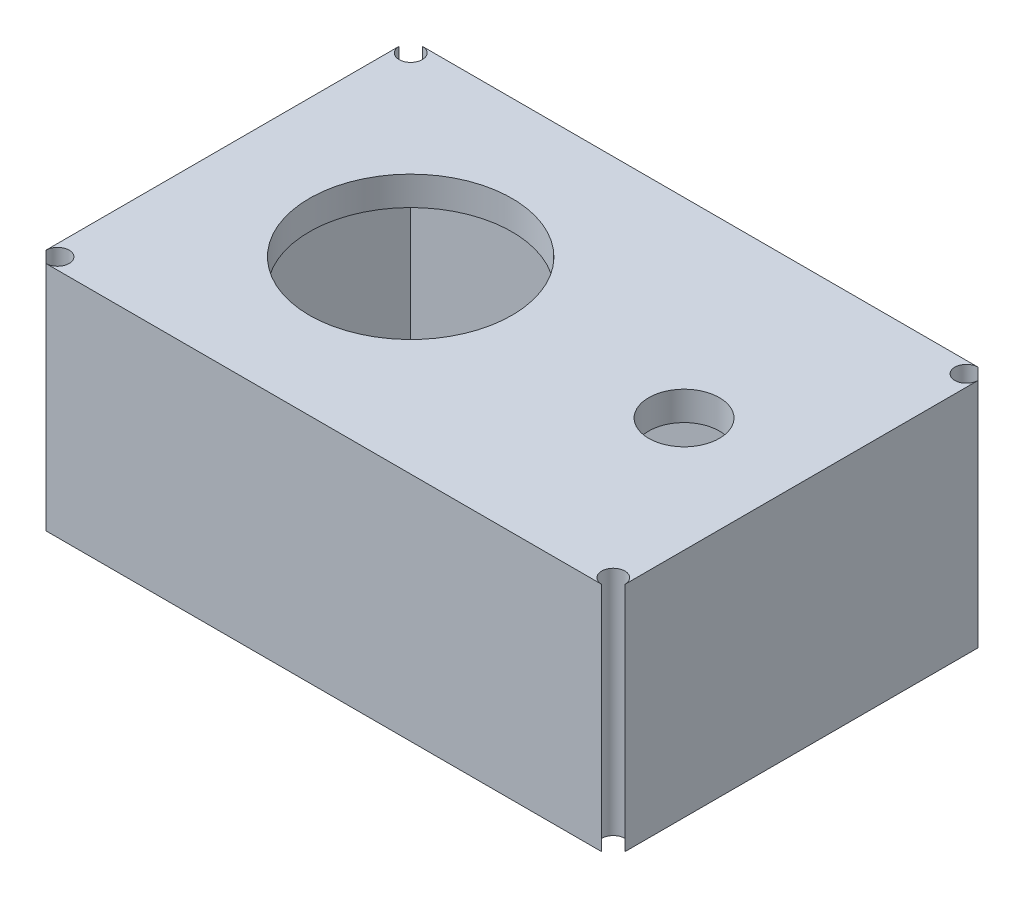
ISO-10303-21;
HEADER;
FILE_DESCRIPTION(('STEP AP214'),'2;1');
FILE_NAME('part.step','',(''),(''),'','','');
FILE_SCHEMA(('AUTOMOTIVE_DESIGN { 1 0 10303 214 1 1 1 1 }'));
ENDSEC;
DATA;
#1=APPLICATION_CONTEXT('core data for automotive mechanical design processes');
#2=APPLICATION_PROTOCOL_DEFINITION('international standard','automotive_design',2000,#1);
#3=PRODUCT_CONTEXT('',#1,'mechanical');
#4=PRODUCT('Part','Part','',(#3));
#5=PRODUCT_RELATED_PRODUCT_CATEGORY('part','',(#4));
#6=PRODUCT_DEFINITION_FORMATION('','',#4);
#7=PRODUCT_DEFINITION_CONTEXT('part definition',#1,'design');
#8=PRODUCT_DEFINITION('design','',#6,#7);
#9=PRODUCT_DEFINITION_SHAPE('','',#8);
#10=(LENGTH_UNIT() NAMED_UNIT(*) SI_UNIT(.MILLI.,.METRE.));
#11=(NAMED_UNIT(*) PLANE_ANGLE_UNIT() SI_UNIT($,.RADIAN.));
#12=(NAMED_UNIT(*) SI_UNIT($,.STERADIAN.) SOLID_ANGLE_UNIT());
#13=UNCERTAINTY_MEASURE_WITH_UNIT(LENGTH_MEASURE(1.E-05),#10,'distance_accuracy_value','');
#14=(GEOMETRIC_REPRESENTATION_CONTEXT(3) GLOBAL_UNCERTAINTY_ASSIGNED_CONTEXT((#13)) GLOBAL_UNIT_ASSIGNED_CONTEXT((#10,
#11,#12)) REPRESENTATION_CONTEXT('',''));
#15=CARTESIAN_POINT('',(0.,0.,0.));
#16=DIRECTION('',(0.,0.,1.));
#17=DIRECTION('',(1.,0.,0.));
#18=AXIS2_PLACEMENT_3D('',#15,#16,#17);
#19=CARTESIAN_POINT('',(0.,40.,0.));
#20=DIRECTION('',(0.,1.,0.));
#21=DIRECTION('',(0.,0.,1.));
#22=AXIS2_PLACEMENT_3D('',#19,#20,#21);
#23=PLANE('',#22);
#24=DIRECTION('',(1.,0.,0.));
#25=VECTOR('',#24,1.);
#26=CARTESIAN_POINT('',(-44.0677966101695,40.,31.9992295839753));
#27=LINE('',#26,#25);
#28=CARTESIAN_POINT('',(-42.0677966101695,40.,31.9992295839753));
#29=VERTEX_POINT('',#28);
#30=CARTESIAN_POINT('',(53.9322033898305,40.,31.9992295839753));
#31=VERTEX_POINT('',#30);
#32=EDGE_CURVE('E171',#29,#31,#27,.T.);
#33=ORIENTED_EDGE('',*,*,#32,.F.);
#34=CARTESIAN_POINT('',(-42.0677966101695,40.,29.9992295839753));
#35=DIRECTION('',(0.,1.,0.));
#36=DIRECTION('',(0.,0.,1.));
#37=AXIS2_PLACEMENT_3D('',#34,#35,#36);
#38=CIRCLE('',#37,2.);
#39=CARTESIAN_POINT('',(-44.0677966101695,40.,29.9992295839753));
#40=VERTEX_POINT('',#39);
#41=EDGE_CURVE('E167',#40,#29,#38,.F.);
#42=ORIENTED_EDGE('',*,*,#41,.F.);
#43=DIRECTION('',(0.,0.,1.));
#44=VECTOR('',#43,1.);
#45=CARTESIAN_POINT('',(-44.0677966101695,40.,-33.0007704160247));
#46=LINE('',#45,#44);
#47=CARTESIAN_POINT('',(-44.0677966101695,40.,-31.0007704160247));
#48=VERTEX_POINT('',#47);
#49=EDGE_CURVE('E163',#48,#40,#46,.T.);
#50=ORIENTED_EDGE('',*,*,#49,.F.);
#51=CARTESIAN_POINT('',(-42.0677966101695,40.,-31.0007704160247));
#52=DIRECTION('',(0.,1.,0.));
#53=DIRECTION('',(0.,0.,1.));
#54=AXIS2_PLACEMENT_3D('',#51,#52,#53);
#55=CIRCLE('',#54,2.);
#56=CARTESIAN_POINT('',(-42.0677966101695,40.,-33.0007704160247));
#57=VERTEX_POINT('',#56);
#58=EDGE_CURVE('E40',#57,#48,#55,.F.);
#59=ORIENTED_EDGE('',*,*,#58,.F.);
#60=DIRECTION('',(-1.,0.,0.));
#61=VECTOR('',#60,1.);
#62=CARTESIAN_POINT('',(-44.0677966101695,40.,-33.0007704160247));
#63=LINE('',#62,#61);
#64=CARTESIAN_POINT('',(53.9322033898305,40.,-33.0007704160247));
#65=VERTEX_POINT('',#64);
#66=EDGE_CURVE('E164',#65,#57,#63,.T.);
#67=ORIENTED_EDGE('',*,*,#66,.F.);
#68=CARTESIAN_POINT('',(53.9322033898305,40.,-31.0007704160247));
#69=DIRECTION('',(0.,1.,0.));
#70=DIRECTION('',(0.,0.,1.));
#71=AXIS2_PLACEMENT_3D('',#68,#69,#70);
#72=CIRCLE('',#71,2.);
#73=CARTESIAN_POINT('',(55.9322033898305,40.,-31.0007704160247));
#74=VERTEX_POINT('',#73);
#75=EDGE_CURVE('E175',#74,#65,#72,.F.);
#76=ORIENTED_EDGE('',*,*,#75,.F.);
#77=DIRECTION('',(0.,0.,1.));
#78=VECTOR('',#77,1.);
#79=CARTESIAN_POINT('',(55.9322033898305,40.,29.9992295839753));
#80=LINE('',#79,#78);
#81=CARTESIAN_POINT('',(55.9322033898305,40.,29.9992295839753));
#82=VERTEX_POINT('',#81);
#83=EDGE_CURVE('E11',#74,#82,#80,.T.);
#84=ORIENTED_EDGE('',*,*,#83,.T.);
#85=CARTESIAN_POINT('',(53.9322033898305,40.,29.9992295839753));
#86=DIRECTION('',(0.,1.,0.));
#87=DIRECTION('',(0.,0.,1.));
#88=AXIS2_PLACEMENT_3D('',#85,#86,#87);
#89=CIRCLE('',#88,2.);
#90=EDGE_CURVE('E48',#31,#82,#89,.F.);
#91=ORIENTED_EDGE('',*,*,#90,.F.);
#92=EDGE_LOOP('',(#33,#42,#50,#59,#67,#76,#84,#91));
#93=FACE_BOUND('',#92,.T.);
#94=DIRECTION('',(0.,0.,1.));
#95=VECTOR('',#94,1.);
#96=CARTESIAN_POINT('',(50.9322033898305,40.,-28.0007704160247));
#97=LINE('',#96,#95);
#98=CARTESIAN_POINT('',(50.9322033898305,40.,-28.0007704160247));
#99=VERTEX_POINT('',#98);
#100=CARTESIAN_POINT('',(50.9322033898305,40.,26.9992295839753));
#101=VERTEX_POINT('',#100);
#102=EDGE_CURVE('E180',#99,#101,#97,.T.);
#103=ORIENTED_EDGE('',*,*,#102,.F.);
#104=DIRECTION('',(1.,0.,0.));
#105=VECTOR('',#104,1.);
#106=CARTESIAN_POINT('',(-39.0677966101695,40.,-28.0007704160247));
#107=LINE('',#106,#105);
#108=CARTESIAN_POINT('',(-39.0677966101695,40.,-28.0007704160247));
#109=VERTEX_POINT('',#108);
#110=EDGE_CURVE('E179',#109,#99,#107,.T.);
#111=ORIENTED_EDGE('',*,*,#110,.F.);
#112=DIRECTION('',(0.,0.,-1.));
#113=VECTOR('',#112,1.);
#114=CARTESIAN_POINT('',(-39.0677966101695,40.,-28.0007704160247));
#115=LINE('',#114,#113);
#116=CARTESIAN_POINT('',(-39.0677966101695,40.,26.9992295839753));
#117=VERTEX_POINT('',#116);
#118=EDGE_CURVE('E174',#117,#109,#115,.T.);
#119=ORIENTED_EDGE('',*,*,#118,.F.);
#120=DIRECTION('',(-1.,0.,0.));
#121=VECTOR('',#120,1.);
#122=CARTESIAN_POINT('',(-39.0677966101695,40.,26.9992295839753));
#123=LINE('',#122,#121);
#124=EDGE_CURVE('E35',#101,#117,#123,.T.);
#125=ORIENTED_EDGE('',*,*,#124,.F.);
#126=EDGE_LOOP('',(#103,#111,#119,#125));
#127=FACE_BOUND('',#126,.T.);
#128=ADVANCED_FACE('F32',(#93,#127),#23,.F.);
#129=CARTESIAN_POINT('',(55.9322033898305,80.,-33.0007704160247));
#130=DIRECTION('',(-1.,0.,0.));
#131=DIRECTION('',(0.,0.,1.));
#132=AXIS2_PLACEMENT_3D('',#129,#130,#131);
#133=PLANE('',#132);
#134=ORIENTED_EDGE('',*,*,#83,.F.);
#135=DIRECTION('',(0.,1.,0.));
#136=VECTOR('',#135,1.);
#137=CARTESIAN_POINT('',(55.9322033898305,-0.00999999999999612,-31.0007704160247));
#138=LINE('',#137,#136);
#139=CARTESIAN_POINT('',(55.9322033898305,80.,-31.0007704160247));
#140=VERTEX_POINT('',#139);
#141=EDGE_CURVE('E161',#74,#140,#138,.T.);
#142=ORIENTED_EDGE('',*,*,#141,.T.);
#143=DIRECTION('',(0.,0.,-1.));
#144=VECTOR('',#143,1.);
#145=CARTESIAN_POINT('',(55.9322033898305,80.,-33.0007704160247));
#146=LINE('',#145,#144);
#147=CARTESIAN_POINT('',(55.9322033898305,80.,29.9992295839753));
#148=VERTEX_POINT('',#147);
#149=EDGE_CURVE('E154',#148,#140,#146,.T.);
#150=ORIENTED_EDGE('',*,*,#149,.F.);
#151=DIRECTION('',(0.,1.,0.));
#152=VECTOR('',#151,1.);
#153=CARTESIAN_POINT('',(55.9322033898305,-0.00999999999999612,29.9992295839753));
#154=LINE('',#153,#152);
#155=EDGE_CURVE('E227',#82,#148,#154,.T.);
#156=ORIENTED_EDGE('',*,*,#155,.F.);
#157=EDGE_LOOP('',(#134,#142,#150,#156));
#158=FACE_BOUND('',#157,.T.);
#159=ADVANCED_FACE('F251',(#158),#133,.F.);
#160=CARTESIAN_POINT('',(50.9322033898305,-175.475115548645,-28.0007704160247));
#161=DIRECTION('',(1.,0.,0.));
#162=DIRECTION('',(0.,0.,-1.));
#163=AXIS2_PLACEMENT_3D('',#160,#161,#162);
#164=PLANE('',#163);
#165=DIRECTION('',(0.,1.,0.));
#166=VECTOR('',#165,1.);
#167=CARTESIAN_POINT('',(50.9322033898305,-175.475115548645,-28.0007704160247));
#168=LINE('',#167,#166);
#169=CARTESIAN_POINT('',(50.9322033898305,75.,-28.0007704160247));
#170=VERTEX_POINT('',#169);
#171=EDGE_CURVE('E151',#99,#170,#168,.T.);
#172=ORIENTED_EDGE('',*,*,#171,.F.);
#173=ORIENTED_EDGE('',*,*,#102,.T.);
#174=DIRECTION('',(0.,1.,0.));
#175=VECTOR('',#174,1.);
#176=CARTESIAN_POINT('',(50.9322033898305,-175.475115548645,26.9992295839753));
#177=LINE('',#176,#175);
#178=CARTESIAN_POINT('',(50.9322033898305,75.,26.9992295839753));
#179=VERTEX_POINT('',#178);
#180=EDGE_CURVE('E193',#101,#179,#177,.T.);
#181=ORIENTED_EDGE('',*,*,#180,.T.);
#182=DIRECTION('',(0.,0.,-1.));
#183=VECTOR('',#182,1.);
#184=CARTESIAN_POINT('',(50.9322033898305,75.,-28.0007704160247));
#185=LINE('',#184,#183);
#186=EDGE_CURVE('E205',#179,#170,#185,.T.);
#187=ORIENTED_EDGE('',*,*,#186,.T.);
#188=EDGE_LOOP('',(#172,#173,#181,#187));
#189=FACE_BOUND('',#188,.T.);
#190=ADVANCED_FACE('F265',(#189),#164,.F.);
#191=CARTESIAN_POINT('',(0.,75.,0.));
#192=DIRECTION('',(0.,1.,0.));
#193=DIRECTION('',(0.,0.,1.));
#194=AXIS2_PLACEMENT_3D('',#191,#192,#193);
#195=PLANE('',#194);
#196=CARTESIAN_POINT('',(36.1553778472485,75.,0.));
#197=DIRECTION('',(0.,1.,0.));
#198=DIRECTION('',(0.,0.,1.));
#199=AXIS2_PLACEMENT_3D('',#196,#197,#198);
#200=CIRCLE('',#199,6.10322585973708);
#201=CARTESIAN_POINT('',(36.1553778472485,75.,6.10322585973708));
#202=VERTEX_POINT('',#201);
#203=EDGE_CURVE('E219',#202,#202,#200,.T.);
#204=ORIENTED_EDGE('',*,*,#203,.T.);
#205=EDGE_LOOP('',(#204));
#206=FACE_BOUND('',#205,.T.);
#207=CARTESIAN_POINT('',(-11.5677966101695,75.,-0.50077041602465));
#208=DIRECTION('',(0.,1.,0.));
#209=DIRECTION('',(0.,0.,1.));
#210=AXIS2_PLACEMENT_3D('',#207,#208,#209);
#211=CIRCLE('',#210,17.5);
#212=CARTESIAN_POINT('',(-11.5677966101695,75.,16.9992295839754));
#213=VERTEX_POINT('',#212);
#214=EDGE_CURVE('E215',#213,#213,#211,.T.);
#215=ORIENTED_EDGE('',*,*,#214,.T.);
#216=EDGE_LOOP('',(#215));
#217=FACE_BOUND('',#216,.T.);
#218=DIRECTION('',(0.,0.,1.));
#219=VECTOR('',#218,1.);
#220=CARTESIAN_POINT('',(-39.0677966101695,75.,-28.0007704160247));
#221=LINE('',#220,#219);
#222=CARTESIAN_POINT('',(-39.0677966101695,75.,-28.0007704160247));
#223=VERTEX_POINT('',#222);
#224=CARTESIAN_POINT('',(-39.0677966101695,75.,26.9992295839753));
#225=VERTEX_POINT('',#224);
#226=EDGE_CURVE('E200',#223,#225,#221,.T.);
#227=ORIENTED_EDGE('',*,*,#226,.F.);
#228=DIRECTION('',(-1.,0.,0.));
#229=VECTOR('',#228,1.);
#230=CARTESIAN_POINT('',(-39.0677966101695,75.,-28.0007704160247));
#231=LINE('',#230,#229);
#232=EDGE_CURVE('E202',#170,#223,#231,.T.);
#233=ORIENTED_EDGE('',*,*,#232,.F.);
#234=ORIENTED_EDGE('',*,*,#186,.F.);
#235=DIRECTION('',(1.,0.,0.));
#236=VECTOR('',#235,1.);
#237=CARTESIAN_POINT('',(-39.0677966101695,75.,26.9992295839753));
#238=LINE('',#237,#236);
#239=EDGE_CURVE('E212',#225,#179,#238,.T.);
#240=ORIENTED_EDGE('',*,*,#239,.F.);
#241=EDGE_LOOP('',(#227,#233,#234,#240));
#242=FACE_BOUND('',#241,.T.);
#243=ADVANCED_FACE('F270',(#206,#217,#242),#195,.F.);
#244=CARTESIAN_POINT('',(-39.0677966101695,-175.475115548645,-28.0007704160247));
#245=DIRECTION('',(0.,0.,-1.));
#246=DIRECTION('',(-1.,0.,0.));
#247=AXIS2_PLACEMENT_3D('',#244,#245,#246);
#248=PLANE('',#247);
#249=DIRECTION('',(0.,1.,0.));
#250=VECTOR('',#249,1.);
#251=CARTESIAN_POINT('',(-39.0677966101695,-175.475115548645,-28.0007704160247));
#252=LINE('',#251,#250);
#253=EDGE_CURVE('E148',#109,#223,#252,.T.);
#254=ORIENTED_EDGE('',*,*,#253,.F.);
#255=ORIENTED_EDGE('',*,*,#110,.T.);
#256=ORIENTED_EDGE('',*,*,#171,.T.);
#257=ORIENTED_EDGE('',*,*,#232,.T.);
#258=EDGE_LOOP('',(#254,#255,#256,#257));
#259=FACE_BOUND('',#258,.T.);
#260=ADVANCED_FACE('F335',(#259),#248,.F.);
#261=CARTESIAN_POINT('',(-39.0677966101695,-175.475115548645,26.9992295839753));
#262=DIRECTION('',(0.,0.,1.));
#263=DIRECTION('',(1.,0.,0.));
#264=AXIS2_PLACEMENT_3D('',#261,#262,#263);
#265=PLANE('',#264);
#266=ORIENTED_EDGE('',*,*,#180,.F.);
#267=ORIENTED_EDGE('',*,*,#124,.T.);
#268=DIRECTION('',(0.,1.,0.));
#269=VECTOR('',#268,1.);
#270=CARTESIAN_POINT('',(-39.0677966101695,-175.475115548645,26.9992295839753));
#271=LINE('',#270,#269);
#272=EDGE_CURVE('E191',#117,#225,#271,.T.);
#273=ORIENTED_EDGE('',*,*,#272,.T.);
#274=ORIENTED_EDGE('',*,*,#239,.T.);
#275=EDGE_LOOP('',(#266,#267,#273,#274));
#276=FACE_BOUND('',#275,.T.);
#277=ADVANCED_FACE('F188',(#276),#265,.F.);
#278=CARTESIAN_POINT('',(-39.0677966101695,-175.475115548645,-28.0007704160247));
#279=DIRECTION('',(-1.,0.,0.));
#280=DIRECTION('',(0.,0.,1.));
#281=AXIS2_PLACEMENT_3D('',#278,#279,#280);
#282=PLANE('',#281);
#283=ORIENTED_EDGE('',*,*,#272,.F.);
#284=ORIENTED_EDGE('',*,*,#118,.T.);
#285=ORIENTED_EDGE('',*,*,#253,.T.);
#286=ORIENTED_EDGE('',*,*,#226,.T.);
#287=EDGE_LOOP('',(#283,#284,#285,#286));
#288=FACE_BOUND('',#287,.T.);
#289=ADVANCED_FACE('F198',(#288),#282,.F.);
#290=CARTESIAN_POINT('',(-11.5677966101695,75.,-0.50077041602465));
#291=DIRECTION('',(0.,1.,0.));
#292=DIRECTION('',(0.,0.,1.));
#293=AXIS2_PLACEMENT_3D('',#290,#291,#292);
#294=CYLINDRICAL_SURFACE('',#293,17.5);
#295=ORIENTED_EDGE('',*,*,#214,.F.);
#296=EDGE_LOOP('',(#295));
#297=FACE_BOUND('',#296,.T.);
#298=CARTESIAN_POINT('',(-11.5677966101695,80.,-0.50077041602465));
#299=DIRECTION('',(0.,1.,0.));
#300=DIRECTION('',(0.,0.,1.));
#301=AXIS2_PLACEMENT_3D('',#298,#299,#300);
#302=CIRCLE('',#301,17.5);
#303=CARTESIAN_POINT('',(-11.5677966101695,80.,16.9992295839754));
#304=VERTEX_POINT('',#303);
#305=EDGE_CURVE('E216',#304,#304,#302,.T.);
#306=ORIENTED_EDGE('',*,*,#305,.T.);
#307=EDGE_LOOP('',(#306));
#308=FACE_BOUND('',#307,.T.);
#309=ADVANCED_FACE('F362',(#297,#308),#294,.F.);
#310=CARTESIAN_POINT('',(36.1553778472485,75.,0.));
#311=DIRECTION('',(0.,1.,0.));
#312=DIRECTION('',(0.,0.,1.));
#313=AXIS2_PLACEMENT_3D('',#310,#311,#312);
#314=CYLINDRICAL_SURFACE('',#313,6.10322585973708);
#315=ORIENTED_EDGE('',*,*,#203,.F.);
#316=EDGE_LOOP('',(#315));
#317=FACE_BOUND('',#316,.T.);
#318=CARTESIAN_POINT('',(36.1553778472485,80.,0.));
#319=DIRECTION('',(0.,1.,0.));
#320=DIRECTION('',(0.,0.,1.));
#321=AXIS2_PLACEMENT_3D('',#318,#319,#320);
#322=CIRCLE('',#321,6.10322585973708);
#323=CARTESIAN_POINT('',(36.1553778472485,80.,6.10322585973708));
#324=VERTEX_POINT('',#323);
#325=EDGE_CURVE('E165',#324,#324,#322,.T.);
#326=ORIENTED_EDGE('',*,*,#325,.T.);
#327=EDGE_LOOP('',(#326));
#328=FACE_BOUND('',#327,.T.);
#329=ADVANCED_FACE('F282',(#317,#328),#314,.F.);
#330=CARTESIAN_POINT('',(-44.0677966101695,80.,-33.0007704160247));
#331=DIRECTION('',(0.,0.,1.));
#332=DIRECTION('',(1.,0.,0.));
#333=AXIS2_PLACEMENT_3D('',#330,#331,#332);
#334=PLANE('',#333);
#335=DIRECTION('',(0.,1.,0.));
#336=VECTOR('',#335,1.);
#337=CARTESIAN_POINT('',(53.9322033898305,-0.00999999999999612,-33.0007704160247));
#338=LINE('',#337,#336);
#339=CARTESIAN_POINT('',(53.9322033898305,80.,-33.0007704160247));
#340=VERTEX_POINT('',#339);
#341=EDGE_CURVE('E142',#65,#340,#338,.T.);
#342=ORIENTED_EDGE('',*,*,#341,.F.);
#343=ORIENTED_EDGE('',*,*,#66,.T.);
#344=DIRECTION('',(0.,1.,0.));
#345=VECTOR('',#344,1.);
#346=CARTESIAN_POINT('',(-42.0677966101695,-0.00999999999999612,-33.0007704160247));
#347=LINE('',#346,#345);
#348=CARTESIAN_POINT('',(-42.0677966101695,80.,-33.0007704160247));
#349=VERTEX_POINT('',#348);
#350=EDGE_CURVE('E160',#57,#349,#347,.T.);
#351=ORIENTED_EDGE('',*,*,#350,.T.);
#352=DIRECTION('',(-1.,0.,0.));
#353=VECTOR('',#352,1.);
#354=CARTESIAN_POINT('',(-44.0677966101695,80.,-33.0007704160247));
#355=LINE('',#354,#353);
#356=EDGE_CURVE('E141',#340,#349,#355,.T.);
#357=ORIENTED_EDGE('',*,*,#356,.F.);
#358=EDGE_LOOP('',(#342,#343,#351,#357));
#359=FACE_BOUND('',#358,.T.);
#360=ADVANCED_FACE('F257',(#359),#334,.F.);
#361=CARTESIAN_POINT('',(53.9322033898305,-0.00999999999999612,-31.0007704160247));
#362=DIRECTION('',(0.,1.,0.));
#363=DIRECTION('',(0.,0.,1.));
#364=AXIS2_PLACEMENT_3D('',#361,#362,#363);
#365=CYLINDRICAL_SURFACE('',#364,2.);
#366=ORIENTED_EDGE('',*,*,#141,.F.);
#367=ORIENTED_EDGE('',*,*,#75,.T.);
#368=ORIENTED_EDGE('',*,*,#341,.T.);
#369=CARTESIAN_POINT('',(53.9322033898305,80.,-31.0007704160247));
#370=DIRECTION('',(0.,1.,0.));
#371=DIRECTION('',(0.,0.,1.));
#372=AXIS2_PLACEMENT_3D('',#369,#370,#371);
#373=CIRCLE('',#372,2.);
#374=EDGE_CURVE('E230',#340,#140,#373,.T.);
#375=ORIENTED_EDGE('',*,*,#374,.T.);
#376=EDGE_LOOP('',(#366,#367,#368,#375));
#377=FACE_BOUND('',#376,.T.);
#378=ADVANCED_FACE('F254',(#377),#365,.F.);
#379=CARTESIAN_POINT('',(53.9322033898305,-0.00999999999999612,29.9992295839753));
#380=DIRECTION('',(0.,1.,0.));
#381=DIRECTION('',(0.,0.,1.));
#382=AXIS2_PLACEMENT_3D('',#379,#380,#381);
#383=CYLINDRICAL_SURFACE('',#382,2.);
#384=DIRECTION('',(0.,1.,0.));
#385=VECTOR('',#384,1.);
#386=CARTESIAN_POINT('',(53.9322033898305,-0.00999999999999612,31.9992295839753));
#387=LINE('',#386,#385);
#388=CARTESIAN_POINT('',(53.9322033898305,80.,31.9992295839753));
#389=VERTEX_POINT('',#388);
#390=EDGE_CURVE('E229',#31,#389,#387,.T.);
#391=ORIENTED_EDGE('',*,*,#390,.F.);
#392=ORIENTED_EDGE('',*,*,#90,.T.);
#393=ORIENTED_EDGE('',*,*,#155,.T.);
#394=CARTESIAN_POINT('',(53.9322033898305,80.,29.9992295839753));
#395=DIRECTION('',(0.,1.,0.));
#396=DIRECTION('',(0.,0.,1.));
#397=AXIS2_PLACEMENT_3D('',#394,#395,#396);
#398=CIRCLE('',#397,2.);
#399=EDGE_CURVE('E233',#148,#389,#398,.T.);
#400=ORIENTED_EDGE('',*,*,#399,.T.);
#401=EDGE_LOOP('',(#391,#392,#393,#400));
#402=FACE_BOUND('',#401,.T.);
#403=ADVANCED_FACE('F249',(#402),#383,.F.);
#404=CARTESIAN_POINT('',(-44.0677966101695,80.,31.9992295839753));
#405=DIRECTION('',(0.,0.,-1.));
#406=DIRECTION('',(-1.,0.,0.));
#407=AXIS2_PLACEMENT_3D('',#404,#405,#406);
#408=PLANE('',#407);
#409=DIRECTION('',(0.,1.,0.));
#410=VECTOR('',#409,1.);
#411=CARTESIAN_POINT('',(-42.0677966101695,-0.00999999999999612,31.9992295839753));
#412=LINE('',#411,#410);
#413=CARTESIAN_POINT('',(-42.0677966101695,80.,31.9992295839753));
#414=VERTEX_POINT('',#413);
#415=EDGE_CURVE('E131',#29,#414,#412,.T.);
#416=ORIENTED_EDGE('',*,*,#415,.F.);
#417=ORIENTED_EDGE('',*,*,#32,.T.);
#418=ORIENTED_EDGE('',*,*,#390,.T.);
#419=DIRECTION('',(1.,0.,0.));
#420=VECTOR('',#419,1.);
#421=CARTESIAN_POINT('',(-44.0677966101695,80.,31.9992295839753));
#422=LINE('',#421,#420);
#423=EDGE_CURVE('E149',#414,#389,#422,.T.);
#424=ORIENTED_EDGE('',*,*,#423,.F.);
#425=EDGE_LOOP('',(#416,#417,#418,#424));
#426=FACE_BOUND('',#425,.T.);
#427=ADVANCED_FACE('F248',(#426),#408,.F.);
#428=CARTESIAN_POINT('',(-42.0677966101695,-0.00999999999999612,29.9992295839753));
#429=DIRECTION('',(0.,1.,0.));
#430=DIRECTION('',(0.,0.,1.));
#431=AXIS2_PLACEMENT_3D('',#428,#429,#430);
#432=CYLINDRICAL_SURFACE('',#431,2.);
#433=DIRECTION('',(0.,1.,0.));
#434=VECTOR('',#433,1.);
#435=CARTESIAN_POINT('',(-44.0677966101695,-0.00999999999999612,29.9992295839753));
#436=LINE('',#435,#434);
#437=CARTESIAN_POINT('',(-44.0677966101695,80.,29.9992295839753));
#438=VERTEX_POINT('',#437);
#439=EDGE_CURVE('E130',#40,#438,#436,.T.);
#440=ORIENTED_EDGE('',*,*,#439,.F.);
#441=ORIENTED_EDGE('',*,*,#41,.T.);
#442=ORIENTED_EDGE('',*,*,#415,.T.);
#443=CARTESIAN_POINT('',(-42.0677966101695,80.,29.9992295839753));
#444=DIRECTION('',(0.,1.,0.));
#445=DIRECTION('',(0.,0.,1.));
#446=AXIS2_PLACEMENT_3D('',#443,#444,#445);
#447=CIRCLE('',#446,2.);
#448=EDGE_CURVE('E143',#414,#438,#447,.T.);
#449=ORIENTED_EDGE('',*,*,#448,.T.);
#450=EDGE_LOOP('',(#440,#441,#442,#449));
#451=FACE_BOUND('',#450,.T.);
#452=ADVANCED_FACE('F242',(#451),#432,.F.);
#453=CARTESIAN_POINT('',(-44.0677966101695,80.,-33.0007704160247));
#454=DIRECTION('',(1.,0.,0.));
#455=DIRECTION('',(0.,0.,-1.));
#456=AXIS2_PLACEMENT_3D('',#453,#454,#455);
#457=PLANE('',#456);
#458=DIRECTION('',(0.,1.,0.));
#459=VECTOR('',#458,1.);
#460=CARTESIAN_POINT('',(-44.0677966101695,-0.00999999999999612,-31.0007704160247));
#461=LINE('',#460,#459);
#462=CARTESIAN_POINT('',(-44.0677966101695,80.,-31.0007704160247));
#463=VERTEX_POINT('',#462);
#464=EDGE_CURVE('E120',#48,#463,#461,.T.);
#465=ORIENTED_EDGE('',*,*,#464,.F.);
#466=ORIENTED_EDGE('',*,*,#49,.T.);
#467=ORIENTED_EDGE('',*,*,#439,.T.);
#468=DIRECTION('',(0.,0.,1.));
#469=VECTOR('',#468,1.);
#470=CARTESIAN_POINT('',(-44.0677966101695,80.,-33.0007704160247));
#471=LINE('',#470,#469);
#472=EDGE_CURVE('E138',#463,#438,#471,.T.);
#473=ORIENTED_EDGE('',*,*,#472,.F.);
#474=EDGE_LOOP('',(#465,#466,#467,#473));
#475=FACE_BOUND('',#474,.T.);
#476=ADVANCED_FACE('F145',(#475),#457,.F.);
#477=CARTESIAN_POINT('',(-42.0677966101695,-0.00999999999999612,-31.0007704160247));
#478=DIRECTION('',(0.,1.,0.));
#479=DIRECTION('',(0.,0.,1.));
#480=AXIS2_PLACEMENT_3D('',#477,#478,#479);
#481=CYLINDRICAL_SURFACE('',#480,2.);
#482=ORIENTED_EDGE('',*,*,#350,.F.);
#483=ORIENTED_EDGE('',*,*,#58,.T.);
#484=ORIENTED_EDGE('',*,*,#464,.T.);
#485=CARTESIAN_POINT('',(-42.0677966101695,80.,-31.0007704160247));
#486=DIRECTION('',(0.,1.,0.));
#487=DIRECTION('',(0.,0.,1.));
#488=AXIS2_PLACEMENT_3D('',#485,#486,#487);
#489=CIRCLE('',#488,2.);
#490=EDGE_CURVE('E124',#463,#349,#489,.T.);
#491=ORIENTED_EDGE('',*,*,#490,.T.);
#492=EDGE_LOOP('',(#482,#483,#484,#491));
#493=FACE_BOUND('',#492,.T.);
#494=ADVANCED_FACE('F123',(#493),#481,.F.);
#495=CARTESIAN_POINT('',(0.,80.,0.));
#496=DIRECTION('',(0.,1.,0.));
#497=DIRECTION('',(0.,0.,1.));
#498=AXIS2_PLACEMENT_3D('',#495,#496,#497);
#499=PLANE('',#498);
#500=ORIENTED_EDGE('',*,*,#490,.F.);
#501=ORIENTED_EDGE('',*,*,#472,.T.);
#502=ORIENTED_EDGE('',*,*,#448,.F.);
#503=ORIENTED_EDGE('',*,*,#423,.T.);
#504=ORIENTED_EDGE('',*,*,#399,.F.);
#505=ORIENTED_EDGE('',*,*,#149,.T.);
#506=ORIENTED_EDGE('',*,*,#374,.F.);
#507=ORIENTED_EDGE('',*,*,#356,.T.);
#508=EDGE_LOOP('',(#500,#501,#502,#503,#504,#505,#506,#507));
#509=FACE_BOUND('',#508,.T.);
#510=ORIENTED_EDGE('',*,*,#325,.F.);
#511=EDGE_LOOP('',(#510));
#512=FACE_BOUND('',#511,.T.);
#513=ORIENTED_EDGE('',*,*,#305,.F.);
#514=EDGE_LOOP('',(#513));
#515=FACE_BOUND('',#514,.T.);
#516=ADVANCED_FACE('F135',(#509,#512,#515),#499,.T.);
#517=CLOSED_SHELL('',(#128,#159,#190,#243,#260,#277,#289,#309,#329,#360,#378,#403,#427,#452,
#476,#494,#516));
#518=MANIFOLD_SOLID_BREP('B2',#517);
#519=ADVANCED_BREP_SHAPE_REPRESENTATION('',(#18,#518),#14);
#520=SHAPE_DEFINITION_REPRESENTATION(#9,#519);
ENDSEC;
END-ISO-10303-21;
